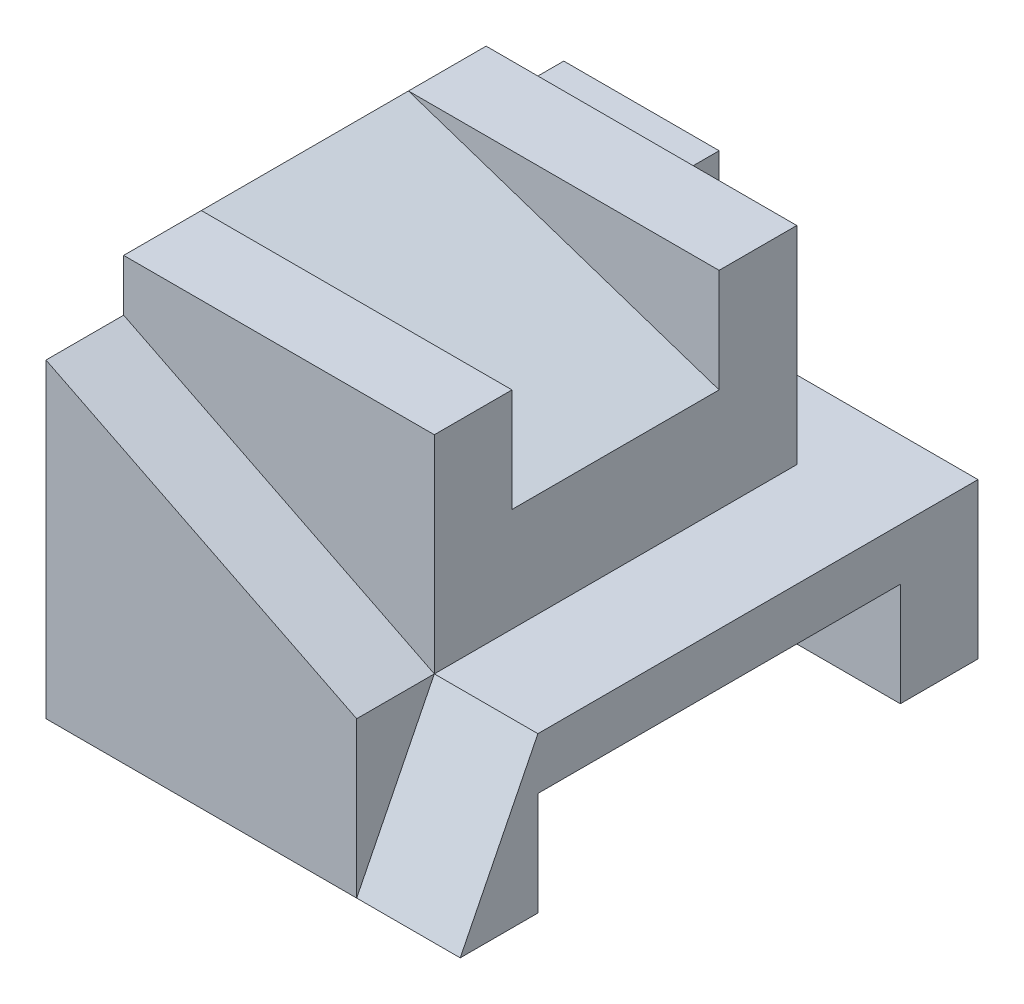
ISO-10303-21;
HEADER;
FILE_DESCRIPTION(('STEP AP214'),'2;1');
FILE_NAME('part.step','',(''),(''),'','','');
FILE_SCHEMA(('AUTOMOTIVE_DESIGN { 1 0 10303 214 1 1 1 1 }'));
ENDSEC;
DATA;
#1=APPLICATION_CONTEXT('core data for automotive mechanical design processes');
#2=APPLICATION_PROTOCOL_DEFINITION('international standard','automotive_design',2000,#1);
#3=PRODUCT_CONTEXT('',#1,'mechanical');
#4=PRODUCT('Part','Part','',(#3));
#5=PRODUCT_RELATED_PRODUCT_CATEGORY('part','',(#4));
#6=PRODUCT_DEFINITION_FORMATION('','',#4);
#7=PRODUCT_DEFINITION_CONTEXT('part definition',#1,'design');
#8=PRODUCT_DEFINITION('design','',#6,#7);
#9=PRODUCT_DEFINITION_SHAPE('','',#8);
#10=(LENGTH_UNIT() NAMED_UNIT(*) SI_UNIT(.MILLI.,.METRE.));
#11=(NAMED_UNIT(*) PLANE_ANGLE_UNIT() SI_UNIT($,.RADIAN.));
#12=(NAMED_UNIT(*) SI_UNIT($,.STERADIAN.) SOLID_ANGLE_UNIT());
#13=UNCERTAINTY_MEASURE_WITH_UNIT(LENGTH_MEASURE(1.E-05),#10,'distance_accuracy_value','');
#14=(GEOMETRIC_REPRESENTATION_CONTEXT(3) GLOBAL_UNCERTAINTY_ASSIGNED_CONTEXT((#13)) GLOBAL_UNIT_ASSIGNED_CONTEXT((#10,
#11,#12)) REPRESENTATION_CONTEXT('',''));
#15=CARTESIAN_POINT('',(0.,0.,0.));
#16=DIRECTION('',(0.,0.,1.));
#17=DIRECTION('',(1.,0.,0.));
#18=AXIS2_PLACEMENT_3D('',#15,#16,#17);
#19=CARTESIAN_POINT('',(-4.,7.,2.));
#20=DIRECTION('',(0.,0.,1.));
#21=DIRECTION('',(1.,0.,0.));
#22=AXIS2_PLACEMENT_3D('',#19,#20,#21);
#23=PLANE('',#22);
#24=DIRECTION('',(-0.948683298050514,0.316227766016838,0.));
#25=VECTOR('',#24,1.);
#26=CARTESIAN_POINT('',(-4.,7.,2.));
#27=LINE('',#26,#25);
#28=CARTESIAN_POINT('',(2.,5.,2.));
#29=VERTEX_POINT('',#28);
#30=CARTESIAN_POINT('',(-4.,7.,2.));
#31=VERTEX_POINT('',#30);
#32=EDGE_CURVE('E169',#29,#31,#27,.T.);
#33=ORIENTED_EDGE('',*,*,#32,.T.);
#34=DIRECTION('',(1.,0.,0.));
#35=VECTOR('',#34,1.);
#36=CARTESIAN_POINT('',(-4.,7.,2.));
#37=LINE('',#36,#35);
#38=CARTESIAN_POINT('',(2.,7.,2.));
#39=VERTEX_POINT('',#38);
#40=EDGE_CURVE('E180',#31,#39,#37,.T.);
#41=ORIENTED_EDGE('',*,*,#40,.T.);
#42=DIRECTION('',(0.,-1.,0.));
#43=VECTOR('',#42,1.);
#44=CARTESIAN_POINT('',(2.,7.,2.));
#45=LINE('',#44,#43);
#46=EDGE_CURVE('E176',#39,#29,#45,.T.);
#47=ORIENTED_EDGE('',*,*,#46,.T.);
#48=EDGE_LOOP('',(#33,#41,#47));
#49=FACE_BOUND('',#48,.T.);
#50=ADVANCED_FACE('F39',(#49),#23,.F.);
#51=CARTESIAN_POINT('',(-4.,7.,-2.));
#52=DIRECTION('',(0.,0.,-1.));
#53=DIRECTION('',(0.,1.,0.));
#54=AXIS2_PLACEMENT_3D('',#51,#52,#53);
#55=PLANE('',#54);
#56=DIRECTION('',(-0.948683298050514,0.316227766016838,0.));
#57=VECTOR('',#56,1.);
#58=CARTESIAN_POINT('',(-4.,7.,-2.));
#59=LINE('',#58,#57);
#60=CARTESIAN_POINT('',(2.,5.,-2.));
#61=VERTEX_POINT('',#60);
#62=CARTESIAN_POINT('',(-4.,7.,-2.));
#63=VERTEX_POINT('',#62);
#64=EDGE_CURVE('E171',#61,#63,#59,.T.);
#65=ORIENTED_EDGE('',*,*,#64,.F.);
#66=DIRECTION('',(0.,1.,0.));
#67=VECTOR('',#66,1.);
#68=CARTESIAN_POINT('',(2.,7.,-2.));
#69=LINE('',#68,#67);
#70=CARTESIAN_POINT('',(2.,7.,-2.));
#71=VERTEX_POINT('',#70);
#72=EDGE_CURVE('E55',#61,#71,#69,.T.);
#73=ORIENTED_EDGE('',*,*,#72,.T.);
#74=DIRECTION('',(1.,0.,0.));
#75=VECTOR('',#74,1.);
#76=CARTESIAN_POINT('',(-4.,7.,-2.));
#77=LINE('',#76,#75);
#78=EDGE_CURVE('E194',#63,#71,#77,.T.);
#79=ORIENTED_EDGE('',*,*,#78,.F.);
#80=EDGE_LOOP('',(#65,#73,#79));
#81=FACE_BOUND('',#80,.T.);
#82=ADVANCED_FACE('F422',(#81),#55,.F.);
#83=CARTESIAN_POINT('',(0.,7.,0.));
#84=DIRECTION('',(0.,-1.,0.));
#85=DIRECTION('',(0.,0.,-1.));
#86=AXIS2_PLACEMENT_3D('',#83,#84,#85);
#87=PLANE('',#86);
#88=DIRECTION('',(0.,0.,-1.));
#89=VECTOR('',#88,1.);
#90=CARTESIAN_POINT('',(2.,7.,3.5));
#91=LINE('',#90,#89);
#92=CARTESIAN_POINT('',(2.,7.,3.5));
#93=VERTEX_POINT('',#92);
#94=EDGE_CURVE('E191',#93,#39,#91,.T.);
#95=ORIENTED_EDGE('',*,*,#94,.T.);
#96=ORIENTED_EDGE('',*,*,#40,.F.);
#97=DIRECTION('',(0.,0.,1.));
#98=VECTOR('',#97,1.);
#99=CARTESIAN_POINT('',(-4.,7.,3.5));
#100=LINE('',#99,#98);
#101=CARTESIAN_POINT('',(-4.,7.,3.5));
#102=VERTEX_POINT('',#101);
#103=EDGE_CURVE('E188',#31,#102,#100,.T.);
#104=ORIENTED_EDGE('',*,*,#103,.T.);
#105=DIRECTION('',(1.,0.,0.));
#106=VECTOR('',#105,1.);
#107=CARTESIAN_POINT('',(-4.,7.,3.5));
#108=LINE('',#107,#106);
#109=EDGE_CURVE('E208',#102,#93,#108,.T.);
#110=ORIENTED_EDGE('',*,*,#109,.T.);
#111=EDGE_LOOP('',(#95,#96,#104,#110));
#112=FACE_BOUND('',#111,.T.);
#113=ADVANCED_FACE('F187',(#112),#87,.F.);
#114=CARTESIAN_POINT('',(0.,3.,0.));
#115=DIRECTION('',(0.,1.,0.));
#116=DIRECTION('',(0.,0.,1.));
#117=AXIS2_PLACEMENT_3D('',#114,#115,#116);
#118=PLANE('',#117);
#119=DIRECTION('',(-1.,0.,0.));
#120=VECTOR('',#119,1.);
#121=CARTESIAN_POINT('',(-4.,3.,-5.));
#122=LINE('',#121,#120);
#123=CARTESIAN_POINT('',(4.,3.,-5.));
#124=VERTEX_POINT('',#123);
#125=CARTESIAN_POINT('',(-1.,3.,-5.));
#126=VERTEX_POINT('',#125);
#127=EDGE_CURVE('E63',#124,#126,#122,.T.);
#128=ORIENTED_EDGE('',*,*,#127,.T.);
#129=DIRECTION('',(0.,0.,-1.));
#130=VECTOR('',#129,1.);
#131=CARTESIAN_POINT('',(-1.,3.,-3.5));
#132=LINE('',#131,#130);
#133=CARTESIAN_POINT('',(-1.,3.,-3.5));
#134=VERTEX_POINT('',#133);
#135=EDGE_CURVE('E193',#134,#126,#132,.T.);
#136=ORIENTED_EDGE('',*,*,#135,.F.);
#137=DIRECTION('',(-1.,0.,0.));
#138=VECTOR('',#137,1.);
#139=CARTESIAN_POINT('',(-4.,3.,-3.5));
#140=LINE('',#139,#138);
#141=CARTESIAN_POINT('',(2.,3.,-3.5));
#142=VERTEX_POINT('',#141);
#143=EDGE_CURVE('E203',#142,#134,#140,.T.);
#144=ORIENTED_EDGE('',*,*,#143,.F.);
#145=DIRECTION('',(0.,0.,-1.));
#146=VECTOR('',#145,1.);
#147=CARTESIAN_POINT('',(2.,3.,3.5));
#148=LINE('',#147,#146);
#149=CARTESIAN_POINT('',(2.,3.,3.5));
#150=VERTEX_POINT('',#149);
#151=EDGE_CURVE('E227',#150,#142,#148,.T.);
#152=ORIENTED_EDGE('',*,*,#151,.F.);
#153=DIRECTION('',(1.,0.,0.));
#154=VECTOR('',#153,1.);
#155=CARTESIAN_POINT('',(2.,3.,3.5));
#156=LINE('',#155,#154);
#157=CARTESIAN_POINT('',(4.,3.,3.5));
#158=VERTEX_POINT('',#157);
#159=EDGE_CURVE('E387',#150,#158,#156,.T.);
#160=ORIENTED_EDGE('',*,*,#159,.T.);
#161=DIRECTION('',(0.,0.,-1.));
#162=VECTOR('',#161,1.);
#163=CARTESIAN_POINT('',(4.,3.,-5.));
#164=LINE('',#163,#162);
#165=EDGE_CURVE('E279',#158,#124,#164,.T.);
#166=ORIENTED_EDGE('',*,*,#165,.T.);
#167=EDGE_LOOP('',(#128,#136,#144,#152,#160,#166));
#168=FACE_BOUND('',#167,.T.);
#169=ADVANCED_FACE('F429',(#168),#118,.T.);
#170=CARTESIAN_POINT('',(-4.,7.,-3.5));
#171=DIRECTION('',(0.,0.,1.));
#172=DIRECTION('',(1.,0.,0.));
#173=AXIS2_PLACEMENT_3D('',#170,#171,#172);
#174=PLANE('',#173);
#175=DIRECTION('',(0.,-1.,0.));
#176=VECTOR('',#175,1.);
#177=CARTESIAN_POINT('',(-1.,6.,-3.5));
#178=LINE('',#177,#176);
#179=CARTESIAN_POINT('',(-1.,6.,-3.5));
#180=VERTEX_POINT('',#179);
#181=EDGE_CURVE('E375',#180,#134,#178,.T.);
#182=ORIENTED_EDGE('',*,*,#181,.F.);
#183=DIRECTION('',(1.,0.,0.));
#184=VECTOR('',#183,1.);
#185=CARTESIAN_POINT('',(-4.,6.,-3.5));
#186=LINE('',#185,#184);
#187=CARTESIAN_POINT('',(-4.,6.,-3.5));
#188=VERTEX_POINT('',#187);
#189=EDGE_CURVE('E353',#188,#180,#186,.T.);
#190=ORIENTED_EDGE('',*,*,#189,.F.);
#191=DIRECTION('',(0.,-1.,0.));
#192=VECTOR('',#191,1.);
#193=CARTESIAN_POINT('',(-4.,7.,-3.5));
#194=LINE('',#193,#192);
#195=CARTESIAN_POINT('',(-4.,7.,-3.5));
#196=VERTEX_POINT('',#195);
#197=EDGE_CURVE('E224',#196,#188,#194,.T.);
#198=ORIENTED_EDGE('',*,*,#197,.F.);
#199=DIRECTION('',(-1.,0.,0.));
#200=VECTOR('',#199,1.);
#201=CARTESIAN_POINT('',(-4.,7.,-3.5));
#202=LINE('',#201,#200);
#203=CARTESIAN_POINT('',(2.,7.,-3.5));
#204=VERTEX_POINT('',#203);
#205=EDGE_CURVE('E221',#204,#196,#202,.T.);
#206=ORIENTED_EDGE('',*,*,#205,.F.);
#207=DIRECTION('',(0.,-1.,0.));
#208=VECTOR('',#207,1.);
#209=CARTESIAN_POINT('',(2.,7.,-3.5));
#210=LINE('',#209,#208);
#211=EDGE_CURVE('E232',#204,#142,#210,.T.);
#212=ORIENTED_EDGE('',*,*,#211,.T.);
#213=ORIENTED_EDGE('',*,*,#143,.T.);
#214=EDGE_LOOP('',(#182,#190,#198,#206,#212,#213));
#215=FACE_BOUND('',#214,.T.);
#216=ADVANCED_FACE('F351',(#215),#174,.F.);
#217=CARTESIAN_POINT('',(-4.,3.,5.));
#218=DIRECTION('',(0.,0.,-1.));
#219=DIRECTION('',(-1.,0.,0.));
#220=AXIS2_PLACEMENT_3D('',#217,#218,#219);
#221=PLANE('',#220);
#222=DIRECTION('',(0.,-1.,0.));
#223=VECTOR('',#222,1.);
#224=CARTESIAN_POINT('',(2.,3.,5.));
#225=LINE('',#224,#223);
#226=CARTESIAN_POINT('',(2.,3.,5.));
#227=VERTEX_POINT('',#226);
#228=CARTESIAN_POINT('',(2.,0.,5.));
#229=VERTEX_POINT('',#228);
#230=EDGE_CURVE('E383',#227,#229,#225,.T.);
#231=ORIENTED_EDGE('',*,*,#230,.F.);
#232=DIRECTION('',(0.894427190999916,-0.447213595499958,0.));
#233=VECTOR('',#232,1.);
#234=CARTESIAN_POINT('',(2.,3.,5.));
#235=LINE('',#234,#233);
#236=CARTESIAN_POINT('',(-4.,6.,5.));
#237=VERTEX_POINT('',#236);
#238=EDGE_CURVE('E393',#237,#227,#235,.T.);
#239=ORIENTED_EDGE('',*,*,#238,.F.);
#240=DIRECTION('',(0.,-1.,0.));
#241=VECTOR('',#240,1.);
#242=CARTESIAN_POINT('',(-4.,3.,5.));
#243=LINE('',#242,#241);
#244=CARTESIAN_POINT('',(-4.,0.,5.));
#245=VERTEX_POINT('',#244);
#246=EDGE_CURVE('E285',#237,#245,#243,.T.);
#247=ORIENTED_EDGE('',*,*,#246,.T.);
#248=DIRECTION('',(1.,0.,0.));
#249=VECTOR('',#248,1.);
#250=CARTESIAN_POINT('',(-4.,0.,5.));
#251=LINE('',#250,#249);
#252=EDGE_CURVE('E282',#245,#229,#251,.T.);
#253=ORIENTED_EDGE('',*,*,#252,.T.);
#254=EDGE_LOOP('',(#231,#239,#247,#253));
#255=FACE_BOUND('',#254,.T.);
#256=ADVANCED_FACE('F407',(#255),#221,.F.);
#257=CARTESIAN_POINT('',(2.,7.,3.5));
#258=DIRECTION('',(-1.,0.,0.));
#259=DIRECTION('',(0.,0.,1.));
#260=AXIS2_PLACEMENT_3D('',#257,#258,#259);
#261=PLANE('',#260);
#262=DIRECTION('',(0.,0.,-1.));
#263=VECTOR('',#262,1.);
#264=CARTESIAN_POINT('',(2.,5.,2.));
#265=LINE('',#264,#263);
#266=EDGE_CURVE('E412',#29,#61,#265,.T.);
#267=ORIENTED_EDGE('',*,*,#266,.F.);
#268=ORIENTED_EDGE('',*,*,#46,.F.);
#269=ORIENTED_EDGE('',*,*,#94,.F.);
#270=DIRECTION('',(0.,-1.,0.));
#271=VECTOR('',#270,1.);
#272=CARTESIAN_POINT('',(2.,7.,3.5));
#273=LINE('',#272,#271);
#274=EDGE_CURVE('E236',#93,#150,#273,.T.);
#275=ORIENTED_EDGE('',*,*,#274,.T.);
#276=ORIENTED_EDGE('',*,*,#151,.T.);
#277=ORIENTED_EDGE('',*,*,#211,.F.);
#278=EDGE_CURVE('E218',#71,#204,#91,.T.);
#279=ORIENTED_EDGE('',*,*,#278,.F.);
#280=ORIENTED_EDGE('',*,*,#72,.F.);
#281=EDGE_LOOP('',(#267,#268,#269,#275,#276,#277,#279,#280));
#282=FACE_BOUND('',#281,.T.);
#283=ADVANCED_FACE('F347',(#282),#261,.F.);
#284=CARTESIAN_POINT('',(0.,0.,0.));
#285=DIRECTION('',(0.,1.,0.));
#286=DIRECTION('',(0.,0.,1.));
#287=AXIS2_PLACEMENT_3D('',#284,#285,#286);
#288=PLANE('',#287);
#289=DIRECTION('',(0.,0.,1.));
#290=VECTOR('',#289,1.);
#291=CARTESIAN_POINT('',(-4.,0.,-5.));
#292=LINE('',#291,#290);
#293=CARTESIAN_POINT('',(-4.,0.,3.5));
#294=VERTEX_POINT('',#293);
#295=EDGE_CURVE('E293',#294,#245,#292,.T.);
#296=ORIENTED_EDGE('',*,*,#295,.F.);
#297=DIRECTION('',(1.,0.,0.));
#298=VECTOR('',#297,1.);
#299=CARTESIAN_POINT('',(-4.,0.,3.5));
#300=LINE('',#299,#298);
#301=CARTESIAN_POINT('',(4.,0.,3.5));
#302=VERTEX_POINT('',#301);
#303=EDGE_CURVE('E256',#294,#302,#300,.T.);
#304=ORIENTED_EDGE('',*,*,#303,.T.);
#305=DIRECTION('',(0.,0.,-1.));
#306=VECTOR('',#305,1.);
#307=CARTESIAN_POINT('',(4.,0.,-5.));
#308=LINE('',#307,#306);
#309=CARTESIAN_POINT('',(4.,0.,5.));
#310=VERTEX_POINT('',#309);
#311=EDGE_CURVE('E286',#310,#302,#308,.T.);
#312=ORIENTED_EDGE('',*,*,#311,.F.);
#313=DIRECTION('',(1.,0.,0.));
#314=VECTOR('',#313,1.);
#315=CARTESIAN_POINT('',(2.,0.,5.));
#316=LINE('',#315,#314);
#317=EDGE_CURVE('E390',#229,#310,#316,.T.);
#318=ORIENTED_EDGE('',*,*,#317,.F.);
#319=ORIENTED_EDGE('',*,*,#252,.F.);
#320=EDGE_LOOP('',(#296,#304,#312,#318,#319));
#321=FACE_BOUND('',#320,.T.);
#322=ADVANCED_FACE('F334',(#321),#288,.F.);
#323=CARTESIAN_POINT('',(4.,3.,-5.));
#324=DIRECTION('',(-1.,0.,0.));
#325=DIRECTION('',(0.,0.,1.));
#326=AXIS2_PLACEMENT_3D('',#323,#324,#325);
#327=PLANE('',#326);
#328=ORIENTED_EDGE('',*,*,#165,.F.);
#329=DIRECTION('',(0.,0.894427190999916,-0.447213595499958));
#330=VECTOR('',#329,1.);
#331=CARTESIAN_POINT('',(4.,0.,5.));
#332=LINE('',#331,#330);
#333=EDGE_CURVE('E379',#310,#158,#332,.T.);
#334=ORIENTED_EDGE('',*,*,#333,.F.);
#335=ORIENTED_EDGE('',*,*,#311,.T.);
#336=DIRECTION('',(0.,-1.,0.));
#337=VECTOR('',#336,1.);
#338=CARTESIAN_POINT('',(4.,0.,3.5));
#339=LINE('',#338,#337);
#340=CARTESIAN_POINT('',(4.,2.,3.5));
#341=VERTEX_POINT('',#340);
#342=EDGE_CURVE('E242',#341,#302,#339,.T.);
#343=ORIENTED_EDGE('',*,*,#342,.F.);
#344=DIRECTION('',(0.,0.,1.));
#345=VECTOR('',#344,1.);
#346=CARTESIAN_POINT('',(4.,2.,3.5));
#347=LINE('',#346,#345);
#348=CARTESIAN_POINT('',(4.,2.,-3.5));
#349=VERTEX_POINT('',#348);
#350=EDGE_CURVE('E248',#349,#341,#347,.T.);
#351=ORIENTED_EDGE('',*,*,#350,.F.);
#352=DIRECTION('',(0.,1.,0.));
#353=VECTOR('',#352,1.);
#354=CARTESIAN_POINT('',(4.,0.,-3.5));
#355=LINE('',#354,#353);
#356=CARTESIAN_POINT('',(4.,0.,-3.5));
#357=VERTEX_POINT('',#356);
#358=EDGE_CURVE('E259',#357,#349,#355,.T.);
#359=ORIENTED_EDGE('',*,*,#358,.F.);
#360=CARTESIAN_POINT('',(4.,0.,-5.));
#361=VERTEX_POINT('',#360);
#362=EDGE_CURVE('E269',#357,#361,#308,.T.);
#363=ORIENTED_EDGE('',*,*,#362,.T.);
#364=DIRECTION('',(0.,-1.,0.));
#365=VECTOR('',#364,1.);
#366=CARTESIAN_POINT('',(4.,3.,-5.));
#367=LINE('',#366,#365);
#368=EDGE_CURVE('E11',#124,#361,#367,.T.);
#369=ORIENTED_EDGE('',*,*,#368,.F.);
#370=EDGE_LOOP('',(#328,#334,#335,#343,#351,#359,#363,#369));
#371=FACE_BOUND('',#370,.T.);
#372=ADVANCED_FACE('F41',(#371),#327,.F.);
#373=CARTESIAN_POINT('',(-4.,3.,-5.));
#374=DIRECTION('',(0.,0.,1.));
#375=DIRECTION('',(1.,0.,0.));
#376=AXIS2_PLACEMENT_3D('',#373,#374,#375);
#377=PLANE('',#376);
#378=DIRECTION('',(-1.,0.,0.));
#379=VECTOR('',#378,1.);
#380=CARTESIAN_POINT('',(-4.,0.,-5.));
#381=LINE('',#380,#379);
#382=CARTESIAN_POINT('',(-4.,0.,-5.));
#383=VERTEX_POINT('',#382);
#384=EDGE_CURVE('E290',#361,#383,#381,.T.);
#385=ORIENTED_EDGE('',*,*,#384,.T.);
#386=DIRECTION('',(0.,-1.,0.));
#387=VECTOR('',#386,1.);
#388=CARTESIAN_POINT('',(-4.,3.,-5.));
#389=LINE('',#388,#387);
#390=CARTESIAN_POINT('',(-4.,6.,-5.));
#391=VERTEX_POINT('',#390);
#392=EDGE_CURVE('E48',#391,#383,#389,.T.);
#393=ORIENTED_EDGE('',*,*,#392,.F.);
#394=DIRECTION('',(-1.,0.,0.));
#395=VECTOR('',#394,1.);
#396=CARTESIAN_POINT('',(-4.,6.,-5.));
#397=LINE('',#396,#395);
#398=CARTESIAN_POINT('',(-1.,6.,-5.));
#399=VERTEX_POINT('',#398);
#400=EDGE_CURVE('E357',#399,#391,#397,.T.);
#401=ORIENTED_EDGE('',*,*,#400,.F.);
#402=DIRECTION('',(0.,-1.,0.));
#403=VECTOR('',#402,1.);
#404=CARTESIAN_POINT('',(-1.,6.,-5.));
#405=LINE('',#404,#403);
#406=EDGE_CURVE('E370',#399,#126,#405,.T.);
#407=ORIENTED_EDGE('',*,*,#406,.T.);
#408=ORIENTED_EDGE('',*,*,#127,.F.);
#409=ORIENTED_EDGE('',*,*,#368,.T.);
#410=EDGE_LOOP('',(#385,#393,#401,#407,#408,#409));
#411=FACE_BOUND('',#410,.T.);
#412=ADVANCED_FACE('F471',(#411),#377,.F.);
#413=CARTESIAN_POINT('',(-4.,3.,-5.));
#414=DIRECTION('',(1.,0.,0.));
#415=DIRECTION('',(0.,0.,-1.));
#416=AXIS2_PLACEMENT_3D('',#413,#414,#415);
#417=PLANE('',#416);
#418=DIRECTION('',(0.,0.,-1.));
#419=VECTOR('',#418,1.);
#420=CARTESIAN_POINT('',(-4.,7.,2.));
#421=LINE('',#420,#419);
#422=EDGE_CURVE('E166',#31,#63,#421,.T.);
#423=ORIENTED_EDGE('',*,*,#422,.T.);
#424=EDGE_CURVE('E202',#196,#63,#100,.T.);
#425=ORIENTED_EDGE('',*,*,#424,.F.);
#426=ORIENTED_EDGE('',*,*,#197,.T.);
#427=DIRECTION('',(0.,0.,1.));
#428=VECTOR('',#427,1.);
#429=CARTESIAN_POINT('',(-4.,6.,-3.5));
#430=LINE('',#429,#428);
#431=EDGE_CURVE('E308',#391,#188,#430,.T.);
#432=ORIENTED_EDGE('',*,*,#431,.F.);
#433=ORIENTED_EDGE('',*,*,#392,.T.);
#434=CARTESIAN_POINT('',(-4.,0.,-3.5));
#435=VERTEX_POINT('',#434);
#436=EDGE_CURVE('E294',#383,#435,#292,.T.);
#437=ORIENTED_EDGE('',*,*,#436,.T.);
#438=DIRECTION('',(0.,1.,0.));
#439=VECTOR('',#438,1.);
#440=CARTESIAN_POINT('',(-4.,0.,-3.5));
#441=LINE('',#440,#439);
#442=CARTESIAN_POINT('',(-4.,2.,-3.5));
#443=VERTEX_POINT('',#442);
#444=EDGE_CURVE('E247',#435,#443,#441,.T.);
#445=ORIENTED_EDGE('',*,*,#444,.T.);
#446=DIRECTION('',(0.,0.,1.));
#447=VECTOR('',#446,1.);
#448=CARTESIAN_POINT('',(-4.,2.,3.5));
#449=LINE('',#448,#447);
#450=CARTESIAN_POINT('',(-4.,2.,3.5));
#451=VERTEX_POINT('',#450);
#452=EDGE_CURVE('E252',#443,#451,#449,.T.);
#453=ORIENTED_EDGE('',*,*,#452,.T.);
#454=DIRECTION('',(0.,-1.,0.));
#455=VECTOR('',#454,1.);
#456=CARTESIAN_POINT('',(-4.,0.,3.5));
#457=LINE('',#456,#455);
#458=EDGE_CURVE('E243',#451,#294,#457,.T.);
#459=ORIENTED_EDGE('',*,*,#458,.T.);
#460=ORIENTED_EDGE('',*,*,#295,.T.);
#461=ORIENTED_EDGE('',*,*,#246,.F.);
#462=DIRECTION('',(0.,0.,1.));
#463=VECTOR('',#462,1.);
#464=CARTESIAN_POINT('',(-4.,6.,3.5));
#465=LINE('',#464,#463);
#466=CARTESIAN_POINT('',(-4.,6.,3.5));
#467=VERTEX_POINT('',#466);
#468=EDGE_CURVE('E214',#467,#237,#465,.T.);
#469=ORIENTED_EDGE('',*,*,#468,.F.);
#470=DIRECTION('',(0.,-1.,0.));
#471=VECTOR('',#470,1.);
#472=CARTESIAN_POINT('',(-4.,7.,3.5));
#473=LINE('',#472,#471);
#474=EDGE_CURVE('E200',#102,#467,#473,.T.);
#475=ORIENTED_EDGE('',*,*,#474,.F.);
#476=ORIENTED_EDGE('',*,*,#103,.F.);
#477=EDGE_LOOP('',(#423,#425,#426,#432,#433,#437,#445,#453,#459,#460,#461,#469,#475,#476));
#478=FACE_BOUND('',#477,.T.);
#479=ADVANCED_FACE('F197',(#478),#417,.F.);
#480=ORIENTED_EDGE('',*,*,#362,.F.);
#481=DIRECTION('',(1.,0.,0.));
#482=VECTOR('',#481,1.);
#483=CARTESIAN_POINT('',(-4.,0.,-3.5));
#484=LINE('',#483,#482);
#485=EDGE_CURVE('E273',#435,#357,#484,.T.);
#486=ORIENTED_EDGE('',*,*,#485,.F.);
#487=ORIENTED_EDGE('',*,*,#436,.F.);
#488=ORIENTED_EDGE('',*,*,#384,.F.);
#489=EDGE_LOOP('',(#480,#486,#487,#488));
#490=FACE_BOUND('',#489,.T.);
#491=ADVANCED_FACE('F316',(#490),#288,.F.);
#492=CARTESIAN_POINT('',(-4.,0.,3.5));
#493=DIRECTION('',(0.,0.,1.));
#494=DIRECTION('',(1.,0.,0.));
#495=AXIS2_PLACEMENT_3D('',#492,#493,#494);
#496=PLANE('',#495);
#497=ORIENTED_EDGE('',*,*,#342,.T.);
#498=ORIENTED_EDGE('',*,*,#303,.F.);
#499=ORIENTED_EDGE('',*,*,#458,.F.);
#500=DIRECTION('',(1.,0.,0.));
#501=VECTOR('',#500,1.);
#502=CARTESIAN_POINT('',(-4.,2.,3.5));
#503=LINE('',#502,#501);
#504=EDGE_CURVE('E266',#451,#341,#503,.T.);
#505=ORIENTED_EDGE('',*,*,#504,.T.);
#506=EDGE_LOOP('',(#497,#498,#499,#505));
#507=FACE_BOUND('',#506,.T.);
#508=ADVANCED_FACE('F459',(#507),#496,.F.);
#509=CARTESIAN_POINT('',(-4.,2.,3.5));
#510=DIRECTION('',(0.,1.,0.));
#511=DIRECTION('',(0.,0.,1.));
#512=AXIS2_PLACEMENT_3D('',#509,#510,#511);
#513=PLANE('',#512);
#514=ORIENTED_EDGE('',*,*,#350,.T.);
#515=ORIENTED_EDGE('',*,*,#504,.F.);
#516=ORIENTED_EDGE('',*,*,#452,.F.);
#517=DIRECTION('',(1.,0.,0.));
#518=VECTOR('',#517,1.);
#519=CARTESIAN_POINT('',(-4.,2.,-3.5));
#520=LINE('',#519,#518);
#521=EDGE_CURVE('E270',#443,#349,#520,.T.);
#522=ORIENTED_EDGE('',*,*,#521,.T.);
#523=EDGE_LOOP('',(#514,#515,#516,#522));
#524=FACE_BOUND('',#523,.T.);
#525=ADVANCED_FACE('F326',(#524),#513,.F.);
#526=CARTESIAN_POINT('',(-4.,0.,-3.5));
#527=DIRECTION('',(0.,0.,-1.));
#528=DIRECTION('',(-1.,0.,0.));
#529=AXIS2_PLACEMENT_3D('',#526,#527,#528);
#530=PLANE('',#529);
#531=ORIENTED_EDGE('',*,*,#358,.T.);
#532=ORIENTED_EDGE('',*,*,#521,.F.);
#533=ORIENTED_EDGE('',*,*,#444,.F.);
#534=ORIENTED_EDGE('',*,*,#485,.T.);
#535=EDGE_LOOP('',(#531,#532,#533,#534));
#536=FACE_BOUND('',#535,.T.);
#537=ADVANCED_FACE('F319',(#536),#530,.F.);
#538=CARTESIAN_POINT('',(-4.,7.,3.5));
#539=DIRECTION('',(0.,0.,-1.));
#540=DIRECTION('',(-1.,0.,0.));
#541=AXIS2_PLACEMENT_3D('',#538,#539,#540);
#542=PLANE('',#541);
#543=ORIENTED_EDGE('',*,*,#474,.T.);
#544=DIRECTION('',(0.894427190999916,-0.447213595499958,0.));
#545=VECTOR('',#544,1.);
#546=CARTESIAN_POINT('',(2.,3.,3.5));
#547=LINE('',#546,#545);
#548=EDGE_CURVE('E397',#467,#150,#547,.T.);
#549=ORIENTED_EDGE('',*,*,#548,.T.);
#550=ORIENTED_EDGE('',*,*,#274,.F.);
#551=ORIENTED_EDGE('',*,*,#109,.F.);
#552=EDGE_LOOP('',(#543,#549,#550,#551));
#553=FACE_BOUND('',#552,.T.);
#554=ADVANCED_FACE('F410',(#553),#542,.F.);
#555=ORIENTED_EDGE('',*,*,#424,.T.);
#556=ORIENTED_EDGE('',*,*,#78,.T.);
#557=ORIENTED_EDGE('',*,*,#278,.T.);
#558=ORIENTED_EDGE('',*,*,#205,.T.);
#559=EDGE_LOOP('',(#555,#556,#557,#558));
#560=FACE_BOUND('',#559,.T.);
#561=ADVANCED_FACE('F343',(#560),#87,.F.);
#562=CARTESIAN_POINT('',(2.,3.,3.5));
#563=DIRECTION('',(-0.447213595499958,-0.894427190999916,0.));
#564=DIRECTION('',(0.894427190999916,-0.447213595499958,0.));
#565=AXIS2_PLACEMENT_3D('',#562,#563,#564);
#566=PLANE('',#565);
#567=ORIENTED_EDGE('',*,*,#238,.T.);
#568=EDGE_CURVE('E210',#227,#150,#148,.T.);
#569=ORIENTED_EDGE('',*,*,#568,.T.);
#570=ORIENTED_EDGE('',*,*,#548,.F.);
#571=ORIENTED_EDGE('',*,*,#468,.T.);
#572=EDGE_LOOP('',(#567,#569,#570,#571));
#573=FACE_BOUND('',#572,.T.);
#574=ADVANCED_FACE('F404',(#573),#566,.F.);
#575=CARTESIAN_POINT('',(2.,0.,5.));
#576=DIRECTION('',(0.,-0.447213595499958,-0.894427190999916));
#577=DIRECTION('',(0.,0.894427190999916,-0.447213595499958));
#578=AXIS2_PLACEMENT_3D('',#575,#576,#577);
#579=PLANE('',#578);
#580=ORIENTED_EDGE('',*,*,#333,.T.);
#581=ORIENTED_EDGE('',*,*,#159,.F.);
#582=DIRECTION('',(0.,0.894427190999916,-0.447213595499958));
#583=VECTOR('',#582,1.);
#584=CARTESIAN_POINT('',(2.,0.,5.));
#585=LINE('',#584,#583);
#586=EDGE_CURVE('E380',#229,#150,#585,.T.);
#587=ORIENTED_EDGE('',*,*,#586,.F.);
#588=ORIENTED_EDGE('',*,*,#317,.T.);
#589=EDGE_LOOP('',(#580,#581,#587,#588));
#590=FACE_BOUND('',#589,.T.);
#591=ADVANCED_FACE('F443',(#590),#579,.F.);
#592=CARTESIAN_POINT('',(2.,0.,0.));
#593=DIRECTION('',(1.,0.,0.));
#594=DIRECTION('',(0.,0.,-1.));
#595=AXIS2_PLACEMENT_3D('',#592,#593,#594);
#596=PLANE('',#595);
#597=ORIENTED_EDGE('',*,*,#586,.T.);
#598=ORIENTED_EDGE('',*,*,#568,.F.);
#599=ORIENTED_EDGE('',*,*,#230,.T.);
#600=EDGE_LOOP('',(#597,#598,#599));
#601=FACE_BOUND('',#600,.T.);
#602=ADVANCED_FACE('F439',(#601),#596,.T.);
#603=CARTESIAN_POINT('',(-1.,6.,-3.5));
#604=DIRECTION('',(-1.,0.,0.));
#605=DIRECTION('',(0.,0.,1.));
#606=AXIS2_PLACEMENT_3D('',#603,#604,#605);
#607=PLANE('',#606);
#608=ORIENTED_EDGE('',*,*,#135,.T.);
#609=ORIENTED_EDGE('',*,*,#406,.F.);
#610=DIRECTION('',(0.,0.,-1.));
#611=VECTOR('',#610,1.);
#612=CARTESIAN_POINT('',(-1.,6.,-3.5));
#613=LINE('',#612,#611);
#614=EDGE_CURVE('E362',#180,#399,#613,.T.);
#615=ORIENTED_EDGE('',*,*,#614,.F.);
#616=ORIENTED_EDGE('',*,*,#181,.T.);
#617=EDGE_LOOP('',(#608,#609,#615,#616));
#618=FACE_BOUND('',#617,.T.);
#619=ADVANCED_FACE('F436',(#618),#607,.F.);
#620=CARTESIAN_POINT('',(0.,6.,0.));
#621=DIRECTION('',(0.,-1.,0.));
#622=DIRECTION('',(0.,0.,-1.));
#623=AXIS2_PLACEMENT_3D('',#620,#621,#622);
#624=PLANE('',#623);
#625=ORIENTED_EDGE('',*,*,#431,.T.);
#626=ORIENTED_EDGE('',*,*,#189,.T.);
#627=ORIENTED_EDGE('',*,*,#614,.T.);
#628=ORIENTED_EDGE('',*,*,#400,.T.);
#629=EDGE_LOOP('',(#625,#626,#627,#628));
#630=FACE_BOUND('',#629,.T.);
#631=ADVANCED_FACE('F355',(#630),#624,.F.);
#632=CARTESIAN_POINT('',(-4.,7.,2.));
#633=DIRECTION('',(-0.316227766016838,-0.948683298050514,0.));
#634=DIRECTION('',(0.948683298050514,-0.316227766016838,0.));
#635=AXIS2_PLACEMENT_3D('',#632,#633,#634);
#636=PLANE('',#635);
#637=ORIENTED_EDGE('',*,*,#64,.T.);
#638=ORIENTED_EDGE('',*,*,#422,.F.);
#639=ORIENTED_EDGE('',*,*,#32,.F.);
#640=ORIENTED_EDGE('',*,*,#266,.T.);
#641=EDGE_LOOP('',(#637,#638,#639,#640));
#642=FACE_BOUND('',#641,.T.);
#643=ADVANCED_FACE('F168',(#642),#636,.F.);
#644=CLOSED_SHELL('',(#50,#82,#113,#169,#216,#256,#283,#322,#372,#412,#479,#491,#508,#525,#537,
#554,#561,#574,#591,#602,#619,#631,#643));
#645=MANIFOLD_SOLID_BREP('B2',#644);
#646=ADVANCED_BREP_SHAPE_REPRESENTATION('',(#18,#645),#14);
#647=SHAPE_DEFINITION_REPRESENTATION(#9,#646);
ENDSEC;
END-ISO-10303-21;
